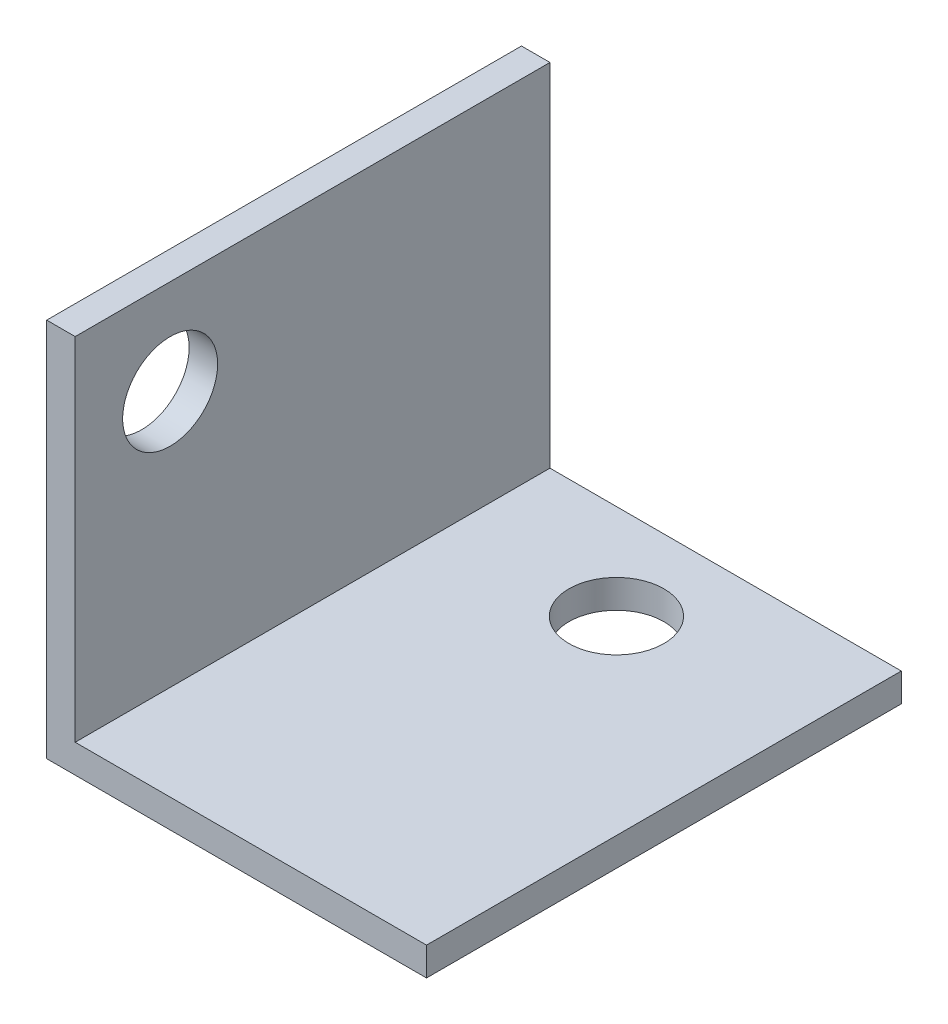
ISO-10303-21;
HEADER;
FILE_DESCRIPTION(('STEP AP214'),'2;1');
FILE_NAME('part.step','',(''),(''),'','','');
FILE_SCHEMA(('AUTOMOTIVE_DESIGN { 1 0 10303 214 1 1 1 1 }'));
ENDSEC;
DATA;
#1=APPLICATION_CONTEXT('core data for automotive mechanical design processes');
#2=APPLICATION_PROTOCOL_DEFINITION('international standard','automotive_design',2000,#1);
#3=PRODUCT_CONTEXT('',#1,'mechanical');
#4=PRODUCT('Part','Part','',(#3));
#5=PRODUCT_RELATED_PRODUCT_CATEGORY('part','',(#4));
#6=PRODUCT_DEFINITION_FORMATION('','',#4);
#7=PRODUCT_DEFINITION_CONTEXT('part definition',#1,'design');
#8=PRODUCT_DEFINITION('design','',#6,#7);
#9=PRODUCT_DEFINITION_SHAPE('','',#8);
#10=(LENGTH_UNIT() NAMED_UNIT(*) SI_UNIT(.MILLI.,.METRE.));
#11=(NAMED_UNIT(*) PLANE_ANGLE_UNIT() SI_UNIT($,.RADIAN.));
#12=(NAMED_UNIT(*) SI_UNIT($,.STERADIAN.) SOLID_ANGLE_UNIT());
#13=UNCERTAINTY_MEASURE_WITH_UNIT(LENGTH_MEASURE(1.E-05),#10,'distance_accuracy_value','');
#14=(GEOMETRIC_REPRESENTATION_CONTEXT(3) GLOBAL_UNCERTAINTY_ASSIGNED_CONTEXT((#13)) GLOBAL_UNIT_ASSIGNED_CONTEXT((#10,
#11,#12)) REPRESENTATION_CONTEXT('',''));
#15=CARTESIAN_POINT('',(0.,0.,0.));
#16=DIRECTION('',(0.,0.,1.));
#17=DIRECTION('',(1.,0.,0.));
#18=AXIS2_PLACEMENT_3D('',#15,#16,#17);
#19=CARTESIAN_POINT('',(1.5,0.,25.));
#20=DIRECTION('',(-1.,0.,0.));
#21=DIRECTION('',(0.,0.,1.));
#22=AXIS2_PLACEMENT_3D('',#19,#20,#21);
#23=PLANE('',#22);
#24=CARTESIAN_POINT('',(1.5,15.,20.));
#25=DIRECTION('',(1.,0.,0.));
#26=DIRECTION('',(0.,0.,-1.));
#27=AXIS2_PLACEMENT_3D('',#24,#25,#26);
#28=CIRCLE('',#27,2.5);
#29=CARTESIAN_POINT('',(1.5,15.,17.5));
#30=VERTEX_POINT('',#29);
#31=EDGE_CURVE('E166',#30,#30,#28,.T.);
#32=ORIENTED_EDGE('',*,*,#31,.F.);
#33=EDGE_LOOP('',(#32));
#34=FACE_BOUND('',#33,.T.);
#35=DIRECTION('',(0.,1.,0.));
#36=VECTOR('',#35,1.);
#37=CARTESIAN_POINT('',(1.5,0.,0.));
#38=LINE('',#37,#36);
#39=CARTESIAN_POINT('',(1.5,1.5,0.));
#40=VERTEX_POINT('',#39);
#41=CARTESIAN_POINT('',(1.5,20.,0.));
#42=VERTEX_POINT('',#41);
#43=EDGE_CURVE('E117',#40,#42,#38,.T.);
#44=ORIENTED_EDGE('',*,*,#43,.T.);
#45=DIRECTION('',(0.,0.,-1.));
#46=VECTOR('',#45,1.);
#47=CARTESIAN_POINT('',(1.5,20.,25.));
#48=LINE('',#47,#46);
#49=CARTESIAN_POINT('',(1.5,20.,25.));
#50=VERTEX_POINT('',#49);
#51=EDGE_CURVE('E11',#50,#42,#48,.T.);
#52=ORIENTED_EDGE('',*,*,#51,.F.);
#53=DIRECTION('',(0.,1.,0.));
#54=VECTOR('',#53,1.);
#55=CARTESIAN_POINT('',(1.5,0.,25.));
#56=LINE('',#55,#54);
#57=CARTESIAN_POINT('',(1.5,1.5,25.));
#58=VERTEX_POINT('',#57);
#59=EDGE_CURVE('E82',#58,#50,#56,.T.);
#60=ORIENTED_EDGE('',*,*,#59,.F.);
#61=DIRECTION('',(0.,0.,-1.));
#62=VECTOR('',#61,1.);
#63=CARTESIAN_POINT('',(1.5,1.5,25.));
#64=LINE('',#63,#62);
#65=EDGE_CURVE('E113',#58,#40,#64,.T.);
#66=ORIENTED_EDGE('',*,*,#65,.T.);
#67=EDGE_LOOP('',(#44,#52,#60,#66));
#68=FACE_BOUND('',#67,.T.);
#69=ADVANCED_FACE('F35',(#34,#68),#23,.F.);
#70=CARTESIAN_POINT('',(0.,20.,25.));
#71=DIRECTION('',(0.,1.,0.));
#72=DIRECTION('',(0.,0.,1.));
#73=AXIS2_PLACEMENT_3D('',#70,#71,#72);
#74=PLANE('',#73);
#75=DIRECTION('',(1.,0.,0.));
#76=VECTOR('',#75,1.);
#77=CARTESIAN_POINT('',(0.,20.,0.));
#78=LINE('',#77,#76);
#79=CARTESIAN_POINT('',(0.,20.,0.));
#80=VERTEX_POINT('',#79);
#81=EDGE_CURVE('E120',#80,#42,#78,.T.);
#82=ORIENTED_EDGE('',*,*,#81,.F.);
#83=DIRECTION('',(0.,0.,-1.));
#84=VECTOR('',#83,1.);
#85=CARTESIAN_POINT('',(0.,20.,25.));
#86=LINE('',#85,#84);
#87=CARTESIAN_POINT('',(0.,20.,25.));
#88=VERTEX_POINT('',#87);
#89=EDGE_CURVE('E44',#88,#80,#86,.T.);
#90=ORIENTED_EDGE('',*,*,#89,.F.);
#91=DIRECTION('',(1.,0.,0.));
#92=VECTOR('',#91,1.);
#93=CARTESIAN_POINT('',(0.,20.,25.));
#94=LINE('',#93,#92);
#95=EDGE_CURVE('E177',#88,#50,#94,.T.);
#96=ORIENTED_EDGE('',*,*,#95,.T.);
#97=ORIENTED_EDGE('',*,*,#51,.T.);
#98=EDGE_LOOP('',(#82,#90,#96,#97));
#99=FACE_BOUND('',#98,.T.);
#100=ADVANCED_FACE('F139',(#99),#74,.T.);
#101=CARTESIAN_POINT('',(0.,0.,25.));
#102=DIRECTION('',(-1.,0.,0.));
#103=DIRECTION('',(0.,0.,1.));
#104=AXIS2_PLACEMENT_3D('',#101,#102,#103);
#105=PLANE('',#104);
#106=CARTESIAN_POINT('',(0.,15.,20.));
#107=DIRECTION('',(1.,0.,0.));
#108=DIRECTION('',(0.,0.,-1.));
#109=AXIS2_PLACEMENT_3D('',#106,#107,#108);
#110=CIRCLE('',#109,2.5);
#111=CARTESIAN_POINT('',(0.,15.,17.5));
#112=VERTEX_POINT('',#111);
#113=EDGE_CURVE('E168',#112,#112,#110,.T.);
#114=ORIENTED_EDGE('',*,*,#113,.T.);
#115=EDGE_LOOP('',(#114));
#116=FACE_BOUND('',#115,.T.);
#117=DIRECTION('',(0.,1.,0.));
#118=VECTOR('',#117,1.);
#119=CARTESIAN_POINT('',(0.,0.,0.));
#120=LINE('',#119,#118);
#121=CARTESIAN_POINT('',(0.,0.,0.));
#122=VERTEX_POINT('',#121);
#123=EDGE_CURVE('E123',#122,#80,#120,.T.);
#124=ORIENTED_EDGE('',*,*,#123,.F.);
#125=DIRECTION('',(0.,0.,-1.));
#126=VECTOR('',#125,1.);
#127=CARTESIAN_POINT('',(0.,0.,25.));
#128=LINE('',#127,#126);
#129=CARTESIAN_POINT('',(0.,0.,25.));
#130=VERTEX_POINT('',#129);
#131=EDGE_CURVE('E103',#130,#122,#128,.T.);
#132=ORIENTED_EDGE('',*,*,#131,.F.);
#133=DIRECTION('',(0.,1.,0.));
#134=VECTOR('',#133,1.);
#135=CARTESIAN_POINT('',(0.,0.,25.));
#136=LINE('',#135,#134);
#137=EDGE_CURVE('E109',#130,#88,#136,.T.);
#138=ORIENTED_EDGE('',*,*,#137,.T.);
#139=ORIENTED_EDGE('',*,*,#89,.T.);
#140=EDGE_LOOP('',(#124,#132,#138,#139));
#141=FACE_BOUND('',#140,.T.);
#142=ADVANCED_FACE('F136',(#116,#141),#105,.T.);
#143=CARTESIAN_POINT('',(0.,0.,25.));
#144=DIRECTION('',(0.,-1.,0.));
#145=DIRECTION('',(0.,0.,-1.));
#146=AXIS2_PLACEMENT_3D('',#143,#144,#145);
#147=PLANE('',#146);
#148=CARTESIAN_POINT('',(10.,0.,5.));
#149=DIRECTION('',(0.,-1.,0.));
#150=DIRECTION('',(0.,0.,-1.));
#151=AXIS2_PLACEMENT_3D('',#148,#149,#150);
#152=CIRCLE('',#151,2.5);
#153=CARTESIAN_POINT('',(10.,0.,2.5));
#154=VERTEX_POINT('',#153);
#155=EDGE_CURVE('E171',#154,#154,#152,.T.);
#156=ORIENTED_EDGE('',*,*,#155,.F.);
#157=EDGE_LOOP('',(#156));
#158=FACE_BOUND('',#157,.T.);
#159=DIRECTION('',(-1.,0.,0.));
#160=VECTOR('',#159,1.);
#161=CARTESIAN_POINT('',(0.,0.,0.));
#162=LINE('',#161,#160);
#163=CARTESIAN_POINT('',(20.,0.,0.));
#164=VERTEX_POINT('',#163);
#165=EDGE_CURVE('E98',#164,#122,#162,.T.);
#166=ORIENTED_EDGE('',*,*,#165,.F.);
#167=DIRECTION('',(0.,0.,-1.));
#168=VECTOR('',#167,1.);
#169=CARTESIAN_POINT('',(20.,0.,25.));
#170=LINE('',#169,#168);
#171=CARTESIAN_POINT('',(20.,0.,25.));
#172=VERTEX_POINT('',#171);
#173=EDGE_CURVE('E93',#172,#164,#170,.T.);
#174=ORIENTED_EDGE('',*,*,#173,.F.);
#175=DIRECTION('',(-1.,0.,0.));
#176=VECTOR('',#175,1.);
#177=CARTESIAN_POINT('',(0.,0.,25.));
#178=LINE('',#177,#176);
#179=EDGE_CURVE('E96',#172,#130,#178,.T.);
#180=ORIENTED_EDGE('',*,*,#179,.T.);
#181=ORIENTED_EDGE('',*,*,#131,.T.);
#182=EDGE_LOOP('',(#166,#174,#180,#181));
#183=FACE_BOUND('',#182,.T.);
#184=ADVANCED_FACE('F95',(#158,#183),#147,.T.);
#185=CARTESIAN_POINT('',(20.,1.5,25.));
#186=DIRECTION('',(1.,0.,0.));
#187=DIRECTION('',(0.,0.,-1.));
#188=AXIS2_PLACEMENT_3D('',#185,#186,#187);
#189=PLANE('',#188);
#190=DIRECTION('',(0.,-1.,0.));
#191=VECTOR('',#190,1.);
#192=CARTESIAN_POINT('',(20.,1.5,0.));
#193=LINE('',#192,#191);
#194=CARTESIAN_POINT('',(20.,1.5,0.));
#195=VERTEX_POINT('',#194);
#196=EDGE_CURVE('E127',#195,#164,#193,.T.);
#197=ORIENTED_EDGE('',*,*,#196,.F.);
#198=DIRECTION('',(0.,0.,-1.));
#199=VECTOR('',#198,1.);
#200=CARTESIAN_POINT('',(20.,1.5,25.));
#201=LINE('',#200,#199);
#202=CARTESIAN_POINT('',(20.,1.5,25.));
#203=VERTEX_POINT('',#202);
#204=EDGE_CURVE('E73',#203,#195,#201,.T.);
#205=ORIENTED_EDGE('',*,*,#204,.F.);
#206=DIRECTION('',(0.,-1.,0.));
#207=VECTOR('',#206,1.);
#208=CARTESIAN_POINT('',(20.,1.5,25.));
#209=LINE('',#208,#207);
#210=EDGE_CURVE('E107',#203,#172,#209,.T.);
#211=ORIENTED_EDGE('',*,*,#210,.T.);
#212=ORIENTED_EDGE('',*,*,#173,.T.);
#213=EDGE_LOOP('',(#197,#205,#211,#212));
#214=FACE_BOUND('',#213,.T.);
#215=ADVANCED_FACE('F111',(#214),#189,.T.);
#216=CARTESIAN_POINT('',(0.,1.5,25.));
#217=DIRECTION('',(0.,-1.,0.));
#218=DIRECTION('',(0.,0.,-1.));
#219=AXIS2_PLACEMENT_3D('',#216,#217,#218);
#220=PLANE('',#219);
#221=CARTESIAN_POINT('',(10.,1.5,5.));
#222=DIRECTION('',(0.,-1.,0.));
#223=DIRECTION('',(0.,0.,-1.));
#224=AXIS2_PLACEMENT_3D('',#221,#222,#223);
#225=CIRCLE('',#224,2.5);
#226=CARTESIAN_POINT('',(10.,1.5,2.5));
#227=VERTEX_POINT('',#226);
#228=EDGE_CURVE('E38',#227,#227,#225,.T.);
#229=ORIENTED_EDGE('',*,*,#228,.T.);
#230=EDGE_LOOP('',(#229));
#231=FACE_BOUND('',#230,.T.);
#232=DIRECTION('',(1.,0.,0.));
#233=VECTOR('',#232,1.);
#234=CARTESIAN_POINT('',(0.,1.5,0.));
#235=LINE('',#234,#233);
#236=EDGE_CURVE('E76',#195,#40,#235,.F.);
#237=ORIENTED_EDGE('',*,*,#236,.T.);
#238=ORIENTED_EDGE('',*,*,#65,.F.);
#239=DIRECTION('',(1.,0.,0.));
#240=VECTOR('',#239,1.);
#241=CARTESIAN_POINT('',(0.,1.5,25.));
#242=LINE('',#241,#240);
#243=EDGE_CURVE('E52',#203,#58,#242,.F.);
#244=ORIENTED_EDGE('',*,*,#243,.F.);
#245=ORIENTED_EDGE('',*,*,#204,.T.);
#246=EDGE_LOOP('',(#237,#238,#244,#245));
#247=FACE_BOUND('',#246,.T.);
#248=ADVANCED_FACE('F144',(#231,#247),#220,.F.);
#249=CARTESIAN_POINT('',(0.,0.,25.));
#250=DIRECTION('',(0.,0.,-1.));
#251=DIRECTION('',(-1.,0.,0.));
#252=AXIS2_PLACEMENT_3D('',#249,#250,#251);
#253=PLANE('',#252);
#254=ORIENTED_EDGE('',*,*,#59,.T.);
#255=ORIENTED_EDGE('',*,*,#95,.F.);
#256=ORIENTED_EDGE('',*,*,#137,.F.);
#257=ORIENTED_EDGE('',*,*,#179,.F.);
#258=ORIENTED_EDGE('',*,*,#210,.F.);
#259=ORIENTED_EDGE('',*,*,#243,.T.);
#260=EDGE_LOOP('',(#254,#255,#256,#257,#258,#259));
#261=FACE_BOUND('',#260,.T.);
#262=ADVANCED_FACE('F106',(#261),#253,.F.);
#263=CARTESIAN_POINT('',(0.,0.,0.));
#264=DIRECTION('',(0.,0.,-1.));
#265=DIRECTION('',(-1.,0.,0.));
#266=AXIS2_PLACEMENT_3D('',#263,#264,#265);
#267=PLANE('',#266);
#268=ORIENTED_EDGE('',*,*,#43,.F.);
#269=ORIENTED_EDGE('',*,*,#236,.F.);
#270=ORIENTED_EDGE('',*,*,#196,.T.);
#271=ORIENTED_EDGE('',*,*,#165,.T.);
#272=ORIENTED_EDGE('',*,*,#123,.T.);
#273=ORIENTED_EDGE('',*,*,#81,.T.);
#274=EDGE_LOOP('',(#268,#269,#270,#271,#272,#273));
#275=FACE_BOUND('',#274,.T.);
#276=ADVANCED_FACE('F142',(#275),#267,.T.);
#277=CARTESIAN_POINT('',(10.,20.,5.));
#278=DIRECTION('',(0.,-1.,0.));
#279=DIRECTION('',(0.,0.,-1.));
#280=AXIS2_PLACEMENT_3D('',#277,#278,#279);
#281=CYLINDRICAL_SURFACE('',#280,2.5);
#282=ORIENTED_EDGE('',*,*,#155,.T.);
#283=EDGE_LOOP('',(#282));
#284=FACE_BOUND('',#283,.T.);
#285=ORIENTED_EDGE('',*,*,#228,.F.);
#286=EDGE_LOOP('',(#285));
#287=FACE_BOUND('',#286,.T.);
#288=ADVANCED_FACE('F182',(#284,#287),#281,.F.);
#289=CARTESIAN_POINT('',(0.,15.,20.));
#290=DIRECTION('',(1.,0.,0.));
#291=DIRECTION('',(0.,0.,-1.));
#292=AXIS2_PLACEMENT_3D('',#289,#290,#291);
#293=CYLINDRICAL_SURFACE('',#292,2.5);
#294=ORIENTED_EDGE('',*,*,#113,.F.);
#295=EDGE_LOOP('',(#294));
#296=FACE_BOUND('',#295,.T.);
#297=ORIENTED_EDGE('',*,*,#31,.T.);
#298=EDGE_LOOP('',(#297));
#299=FACE_BOUND('',#298,.T.);
#300=ADVANCED_FACE('F184',(#296,#299),#293,.F.);
#301=CLOSED_SHELL('',(#69,#100,#142,#184,#215,#248,#262,#276,#288,#300));
#302=MANIFOLD_SOLID_BREP('B2',#301);
#303=ADVANCED_BREP_SHAPE_REPRESENTATION('',(#18,#302),#14);
#304=SHAPE_DEFINITION_REPRESENTATION(#9,#303);
ENDSEC;
END-ISO-10303-21;
